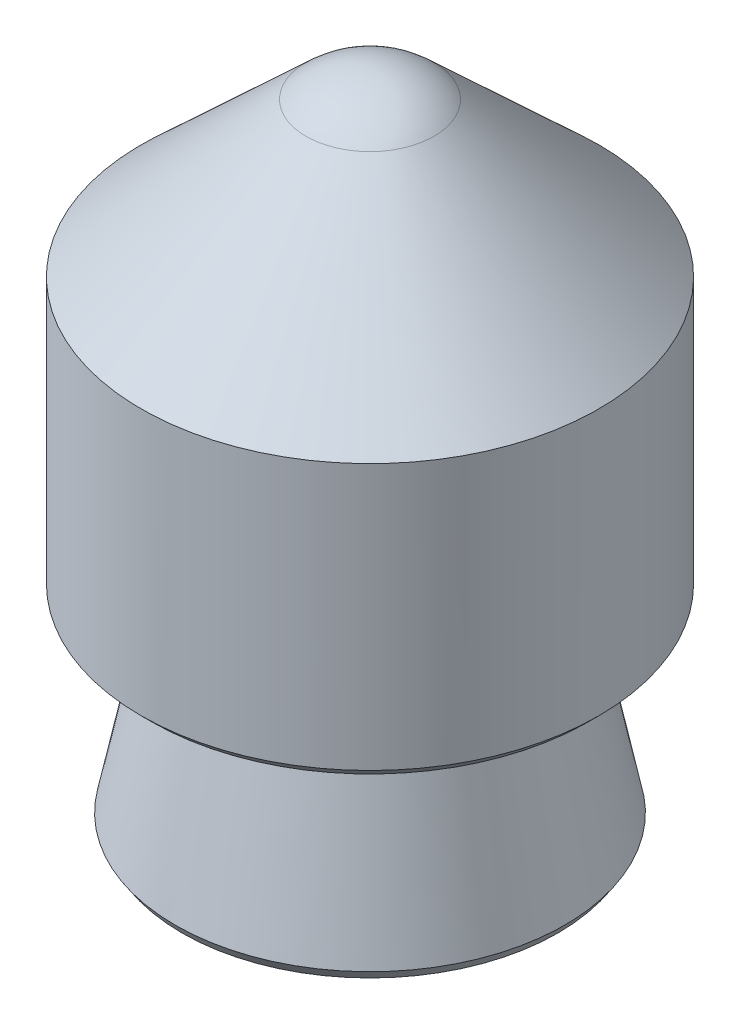
ISO-10303-21;
HEADER;
FILE_DESCRIPTION(('STEP AP214'),'2;1');
FILE_NAME('part.step','',(''),(''),'','','');
FILE_SCHEMA(('AUTOMOTIVE_DESIGN { 1 0 10303 214 1 1 1 1 }'));
ENDSEC;
DATA;
#1=APPLICATION_CONTEXT('core data for automotive mechanical design processes');
#2=APPLICATION_PROTOCOL_DEFINITION('international standard','automotive_design',2000,#1);
#3=PRODUCT_CONTEXT('',#1,'mechanical');
#4=PRODUCT('Part','Part','',(#3));
#5=PRODUCT_RELATED_PRODUCT_CATEGORY('part','',(#4));
#6=PRODUCT_DEFINITION_FORMATION('','',#4);
#7=PRODUCT_DEFINITION_CONTEXT('part definition',#1,'design');
#8=PRODUCT_DEFINITION('design','',#6,#7);
#9=PRODUCT_DEFINITION_SHAPE('','',#8);
#10=(LENGTH_UNIT() NAMED_UNIT(*) SI_UNIT(.MILLI.,.METRE.));
#11=(NAMED_UNIT(*) PLANE_ANGLE_UNIT() SI_UNIT($,.RADIAN.));
#12=(NAMED_UNIT(*) SI_UNIT($,.STERADIAN.) SOLID_ANGLE_UNIT());
#13=UNCERTAINTY_MEASURE_WITH_UNIT(LENGTH_MEASURE(1.E-05),#10,'distance_accuracy_value','');
#14=(GEOMETRIC_REPRESENTATION_CONTEXT(3) GLOBAL_UNCERTAINTY_ASSIGNED_CONTEXT((#13)) GLOBAL_UNIT_ASSIGNED_CONTEXT((#10,
#11,#12)) REPRESENTATION_CONTEXT('',''));
#15=CARTESIAN_POINT('',(0.,0.,0.));
#16=DIRECTION('',(0.,0.,1.));
#17=DIRECTION('',(1.,0.,0.));
#18=AXIS2_PLACEMENT_3D('',#15,#16,#17);
#19=CARTESIAN_POINT('',(0.,25.4,0.));
#20=DIRECTION('',(0.,1.,0.));
#21=DIRECTION('',(0.,0.,1.));
#22=AXIS2_PLACEMENT_3D('',#19,#20,#21);
#23=PLANE('',#22);
#24=CARTESIAN_POINT('',(0.,25.4,0.));
#25=DIRECTION('',(0.,-1.,0.));
#26=DIRECTION('',(0.,0.,-1.));
#27=AXIS2_PLACEMENT_3D('',#24,#25,#26);
#28=CIRCLE('',#27,3.5);
#29=CARTESIAN_POINT('',(0.,25.4,-3.5));
#30=VERTEX_POINT('',#29);
#31=EDGE_CURVE('E62',#30,#30,#28,.T.);
#32=ORIENTED_EDGE('',*,*,#31,.F.);
#33=EDGE_LOOP('',(#32));
#34=FACE_BOUND('',#33,.T.);
#35=CARTESIAN_POINT('',(0.,25.4,0.));
#36=DIRECTION('',(0.,1.,0.));
#37=DIRECTION('',(0.,0.,1.));
#38=AXIS2_PLACEMENT_3D('',#35,#36,#37);
#39=CIRCLE('',#38,4.59156114236063);
#40=CARTESIAN_POINT('',(0.,25.4,4.59156114236063));
#41=VERTEX_POINT('',#40);
#42=EDGE_CURVE('E47',#41,#41,#39,.F.);
#43=ORIENTED_EDGE('',*,*,#42,.T.);
#44=EDGE_LOOP('',(#43));
#45=FACE_BOUND('',#44,.T.);
#46=ADVANCED_FACE('F39',(#34,#45),#23,.F.);
#47=CARTESIAN_POINT('',(0.,30.2387,0.));
#48=DIRECTION('',(0.,-1.,0.));
#49=DIRECTION('',(0.,0.,-1.));
#50=AXIS2_PLACEMENT_3D('',#47,#48,#49);
#51=CONICAL_SURFACE('',#50,3.8227,0.200674236626133);
#52=CARTESIAN_POINT('',(0.,25.6489028308561,0.));
#53=DIRECTION('',(0.,1.,0.));
#54=DIRECTION('',(0.,0.,1.));
#55=AXIS2_PLACEMENT_3D('',#52,#53,#54);
#56=CIRCLE('',#55,4.75632015907782);
#57=CARTESIAN_POINT('',(0.,25.6489028308561,4.75632015907782));
#58=VERTEX_POINT('',#57);
#59=EDGE_CURVE('E11',#58,#58,#56,.T.);
#60=ORIENTED_EDGE('',*,*,#59,.T.);
#61=EDGE_LOOP('',(#60));
#62=FACE_BOUND('',#61,.T.);
#63=CARTESIAN_POINT('',(0.,30.2387,0.));
#64=DIRECTION('',(0.,-1.,0.));
#65=DIRECTION('',(0.,0.,-1.));
#66=AXIS2_PLACEMENT_3D('',#63,#64,#65);
#67=CIRCLE('',#66,3.8227);
#68=CARTESIAN_POINT('',(0.,30.2387,-3.8227));
#69=VERTEX_POINT('',#68);
#70=EDGE_CURVE('E75',#69,#69,#67,.T.);
#71=ORIENTED_EDGE('',*,*,#70,.T.);
#72=EDGE_LOOP('',(#71));
#73=FACE_BOUND('',#72,.T.);
#74=ADVANCED_FACE('F102',(#62,#73),#51,.T.);
#75=CARTESIAN_POINT('',(-3.8227,30.2387,0.));
#76=DIRECTION('',(0.,1.,0.));
#77=DIRECTION('',(0.,0.,1.));
#78=AXIS2_PLACEMENT_3D('',#75,#76,#77);
#79=PLANE('',#78);
#80=CARTESIAN_POINT('',(0.,30.2387,0.));
#81=DIRECTION('',(0.,1.,0.));
#82=DIRECTION('',(0.,0.,1.));
#83=AXIS2_PLACEMENT_3D('',#80,#81,#82);
#84=CIRCLE('',#83,5.334);
#85=CARTESIAN_POINT('',(0.,30.2387,5.334));
#86=VERTEX_POINT('',#85);
#87=EDGE_CURVE('E78',#86,#86,#84,.F.);
#88=ORIENTED_EDGE('',*,*,#87,.T.);
#89=EDGE_LOOP('',(#88));
#90=FACE_BOUND('',#89,.T.);
#91=ORIENTED_EDGE('',*,*,#70,.F.);
#92=EDGE_LOOP('',(#91));
#93=FACE_BOUND('',#92,.T.);
#94=ADVANCED_FACE('F108',(#90,#93),#79,.F.);
#95=CARTESIAN_POINT('',(0.,25.4,0.));
#96=DIRECTION('',(0.,-1.,0.));
#97=DIRECTION('',(0.,0.,-1.));
#98=AXIS2_PLACEMENT_3D('',#95,#96,#97);
#99=CYLINDRICAL_SURFACE('',#98,5.588);
#100=CARTESIAN_POINT('',(0.,30.4927,0.));
#101=DIRECTION('',(0.,1.,0.));
#102=DIRECTION('',(0.,0.,1.));
#103=AXIS2_PLACEMENT_3D('',#100,#101,#102);
#104=CIRCLE('',#103,5.588);
#105=CARTESIAN_POINT('',(0.,30.4927,5.588));
#106=VERTEX_POINT('',#105);
#107=EDGE_CURVE('E81',#106,#106,#104,.T.);
#108=ORIENTED_EDGE('',*,*,#107,.T.);
#109=EDGE_LOOP('',(#108));
#110=FACE_BOUND('',#109,.T.);
#111=CARTESIAN_POINT('',(0.,36.9824,0.));
#112=DIRECTION('',(0.,-1.,0.));
#113=DIRECTION('',(0.,0.,-1.));
#114=AXIS2_PLACEMENT_3D('',#111,#112,#113);
#115=CIRCLE('',#114,5.588);
#116=CARTESIAN_POINT('',(0.,36.9824,-5.588));
#117=VERTEX_POINT('',#116);
#118=EDGE_CURVE('E72',#117,#117,#115,.T.);
#119=ORIENTED_EDGE('',*,*,#118,.T.);
#120=EDGE_LOOP('',(#119));
#121=FACE_BOUND('',#120,.T.);
#122=ADVANCED_FACE('F115',(#110,#121),#99,.T.);
#123=CARTESIAN_POINT('',(0.,40.7353792951679,0.));
#124=DIRECTION('',(0.,-1.,0.));
#125=DIRECTION('',(0.,0.,-1.));
#126=AXIS2_PLACEMENT_3D('',#123,#124,#125);
#127=CONICAL_SURFACE('',#126,1.56336753354535,0.820311552481936);
#128=ORIENTED_EDGE('',*,*,#118,.F.);
#129=EDGE_LOOP('',(#128));
#130=FACE_BOUND('',#129,.T.);
#131=CARTESIAN_POINT('',(0.,40.7353792951679,0.));
#132=DIRECTION('',(0.,-1.,0.));
#133=DIRECTION('',(0.,0.,-1.));
#134=AXIS2_PLACEMENT_3D('',#131,#132,#133);
#135=CIRCLE('',#134,1.56336753354535);
#136=CARTESIAN_POINT('',(0.,40.7353792951679,-1.56336753354535));
#137=VERTEX_POINT('',#136);
#138=EDGE_CURVE('E67',#137,#137,#135,.T.);
#139=ORIENTED_EDGE('',*,*,#138,.T.);
#140=EDGE_LOOP('',(#139));
#141=FACE_BOUND('',#140,.T.);
#142=ADVANCED_FACE('F119',(#130,#141),#127,.T.);
#143=CARTESIAN_POINT('',(0.,39.05885,0.));
#144=DIRECTION('',(0.,-1.,0.));
#145=DIRECTION('',(-1.,0.,0.));
#146=AXIS2_PLACEMENT_3D('',#143,#144,#145);
#147=SPHERICAL_SURFACE('',#146,2.29235);
#148=ORIENTED_EDGE('',*,*,#138,.F.);
#149=EDGE_LOOP('',(#148));
#150=FACE_BOUND('',#149,.T.);
#151=ADVANCED_FACE('F98',(#150),#147,.T.);
#152=CARTESIAN_POINT('',(0.,30.2387,0.));
#153=DIRECTION('',(0.,1.,0.));
#154=DIRECTION('',(0.,0.,1.));
#155=AXIS2_PLACEMENT_3D('',#152,#153,#154);
#156=CONICAL_SURFACE('',#155,5.334,0.785398163397443);
#157=ORIENTED_EDGE('',*,*,#107,.F.);
#158=EDGE_LOOP('',(#157));
#159=FACE_BOUND('',#158,.T.);
#160=ORIENTED_EDGE('',*,*,#87,.F.);
#161=EDGE_LOOP('',(#160));
#162=FACE_BOUND('',#161,.T.);
#163=ADVANCED_FACE('F90',(#159,#162),#156,.T.);
#164=CARTESIAN_POINT('',(0.,25.4,0.));
#165=DIRECTION('',(0.,1.,0.));
#166=DIRECTION('',(0.,0.,1.));
#167=AXIS2_PLACEMENT_3D('',#164,#165,#166);
#168=CONICAL_SURFACE('',#167,4.59156114236063,0.584723926771309);
#169=ORIENTED_EDGE('',*,*,#59,.F.);
#170=EDGE_LOOP('',(#169));
#171=FACE_BOUND('',#170,.T.);
#172=ORIENTED_EDGE('',*,*,#42,.F.);
#173=EDGE_LOOP('',(#172));
#174=FACE_BOUND('',#173,.T.);
#175=ADVANCED_FACE('F41',(#171,#174),#168,.T.);
#176=CARTESIAN_POINT('',(0.,27.9,0.));
#177=DIRECTION('',(0.,-1.,0.));
#178=DIRECTION('',(0.,0.,-1.));
#179=AXIS2_PLACEMENT_3D('',#176,#177,#178);
#180=CYLINDRICAL_SURFACE('',#179,3.5);
#181=CARTESIAN_POINT('',(0.,27.9,0.));
#182=DIRECTION('',(0.,-1.,0.));
#183=DIRECTION('',(0.,0.,-1.));
#184=AXIS2_PLACEMENT_3D('',#181,#182,#183);
#185=CIRCLE('',#184,3.5);
#186=CARTESIAN_POINT('',(0.,27.9,-3.5));
#187=VERTEX_POINT('',#186);
#188=EDGE_CURVE('E64',#187,#187,#185,.T.);
#189=ORIENTED_EDGE('',*,*,#188,.F.);
#190=EDGE_LOOP('',(#189));
#191=FACE_BOUND('',#190,.T.);
#192=ORIENTED_EDGE('',*,*,#31,.T.);
#193=EDGE_LOOP('',(#192));
#194=FACE_BOUND('',#193,.T.);
#195=ADVANCED_FACE('F89',(#191,#194),#180,.F.);
#196=CARTESIAN_POINT('',(0.,27.9,0.));
#197=DIRECTION('',(0.,-1.,0.));
#198=DIRECTION('',(0.,0.,-1.));
#199=AXIS2_PLACEMENT_3D('',#196,#197,#198);
#200=PLANE('',#199);
#201=CARTESIAN_POINT('',(0.,27.9,0.));
#202=DIRECTION('',(0.,-1.,0.));
#203=DIRECTION('',(0.,0.,-1.));
#204=AXIS2_PLACEMENT_3D('',#201,#202,#203);
#205=CIRCLE('',#204,2.99999999999999);
#206=CARTESIAN_POINT('',(0.,27.9,-2.99999999999999));
#207=VERTEX_POINT('',#206);
#208=EDGE_CURVE('E43',#207,#207,#205,.T.);
#209=ORIENTED_EDGE('',*,*,#208,.F.);
#210=EDGE_LOOP('',(#209));
#211=FACE_BOUND('',#210,.T.);
#212=ORIENTED_EDGE('',*,*,#188,.T.);
#213=EDGE_LOOP('',(#212));
#214=FACE_BOUND('',#213,.T.);
#215=ADVANCED_FACE('F54',(#211,#214),#200,.T.);
#216=CARTESIAN_POINT('',(0.,36.354004,0.));
#217=DIRECTION('',(0.,-1.,0.));
#218=DIRECTION('',(0.,0.,-1.));
#219=AXIS2_PLACEMENT_3D('',#216,#217,#218);
#220=CONICAL_SURFACE('',#219,3.,1.02974425867665);
#221=CARTESIAN_POINT('',(0.,38.1565858570827,0.));
#222=VERTEX_POINT('',#221);
#223=VERTEX_LOOP('',#222);
#224=FACE_BOUND('',#223,.T.);
#225=CARTESIAN_POINT('',(0.,36.354004,0.));
#226=DIRECTION('',(0.,-1.,0.));
#227=DIRECTION('',(0.,0.,-1.));
#228=AXIS2_PLACEMENT_3D('',#225,#226,#227);
#229=CIRCLE('',#228,3.);
#230=CARTESIAN_POINT('',(0.,36.354004,-3.));
#231=VERTEX_POINT('',#230);
#232=EDGE_CURVE('E58',#231,#231,#229,.T.);
#233=ORIENTED_EDGE('',*,*,#232,.T.);
#234=EDGE_LOOP('',(#233));
#235=FACE_BOUND('',#234,.T.);
#236=ADVANCED_FACE('F50',(#224,#235),#220,.F.);
#237=CARTESIAN_POINT('',(0.,25.4,0.));
#238=DIRECTION('',(0.,-1.,0.));
#239=DIRECTION('',(0.,0.,-1.));
#240=AXIS2_PLACEMENT_3D('',#237,#238,#239);
#241=CYLINDRICAL_SURFACE('',#240,2.99999999999999);
#242=ORIENTED_EDGE('',*,*,#208,.T.);
#243=EDGE_LOOP('',(#242));
#244=FACE_BOUND('',#243,.T.);
#245=ORIENTED_EDGE('',*,*,#232,.F.);
#246=EDGE_LOOP('',(#245));
#247=FACE_BOUND('',#246,.T.);
#248=ADVANCED_FACE('F53',(#244,#247),#241,.F.);
#249=CLOSED_SHELL('',(#46,#74,#94,#122,#142,#151,#163,#175,#195,#215,#236,#248));
#250=MANIFOLD_SOLID_BREP('B2',#249);
#251=ADVANCED_BREP_SHAPE_REPRESENTATION('',(#18,#250),#14);
#252=SHAPE_DEFINITION_REPRESENTATION(#9,#251);
ENDSEC;
END-ISO-10303-21;
